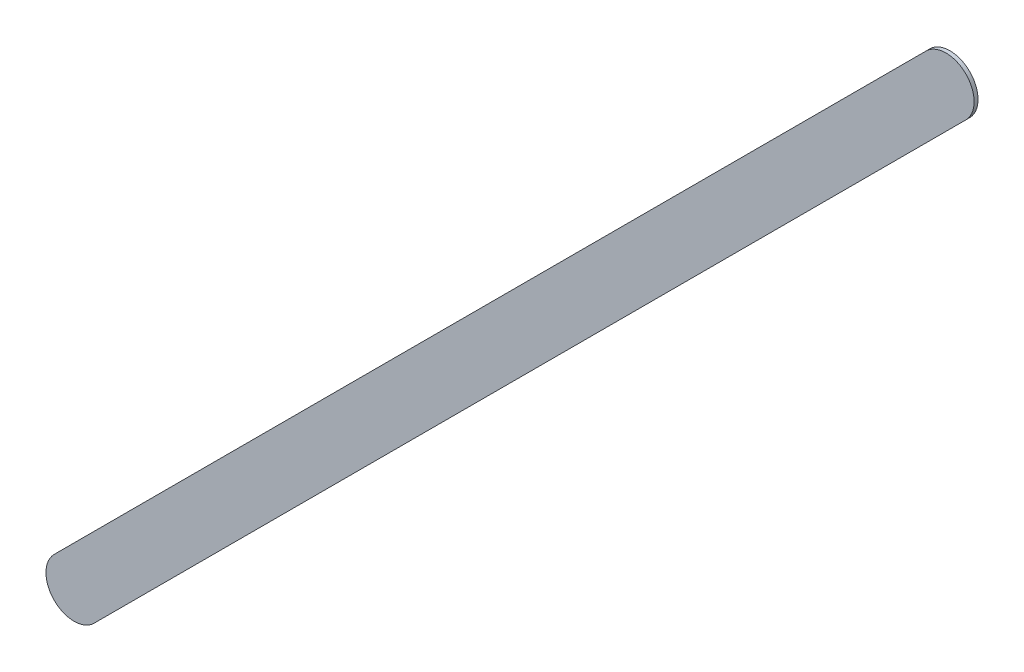
ISO-10303-21;
HEADER;
FILE_DESCRIPTION(('STEP AP214'),'2;1');
FILE_NAME('part.step','',(''),(''),'','','');
FILE_SCHEMA(('AUTOMOTIVE_DESIGN { 1 0 10303 214 1 1 1 1 }'));
ENDSEC;
DATA;
#1=APPLICATION_CONTEXT('core data for automotive mechanical design processes');
#2=APPLICATION_PROTOCOL_DEFINITION('international standard','automotive_design',2000,#1);
#3=PRODUCT_CONTEXT('',#1,'mechanical');
#4=PRODUCT('Part','Part','',(#3));
#5=PRODUCT_RELATED_PRODUCT_CATEGORY('part','',(#4));
#6=PRODUCT_DEFINITION_FORMATION('','',#4);
#7=PRODUCT_DEFINITION_CONTEXT('part definition',#1,'design');
#8=PRODUCT_DEFINITION('design','',#6,#7);
#9=PRODUCT_DEFINITION_SHAPE('','',#8);
#10=(LENGTH_UNIT() NAMED_UNIT(*) SI_UNIT(.MILLI.,.METRE.));
#11=(NAMED_UNIT(*) PLANE_ANGLE_UNIT() SI_UNIT($,.RADIAN.));
#12=(NAMED_UNIT(*) SI_UNIT($,.STERADIAN.) SOLID_ANGLE_UNIT());
#13=UNCERTAINTY_MEASURE_WITH_UNIT(LENGTH_MEASURE(1.E-05),#10,'distance_accuracy_value','');
#14=(GEOMETRIC_REPRESENTATION_CONTEXT(3) GLOBAL_UNCERTAINTY_ASSIGNED_CONTEXT((#13)) GLOBAL_UNIT_ASSIGNED_CONTEXT((#10,
#11,#12)) REPRESENTATION_CONTEXT('',''));
#15=CARTESIAN_POINT('',(0.,0.,0.));
#16=DIRECTION('',(0.,0.,1.));
#17=DIRECTION('',(1.,0.,0.));
#18=AXIS2_PLACEMENT_3D('',#15,#16,#17);
#19=CARTESIAN_POINT('',(126.950223,-70.435223,0.));
#20=DIRECTION('',(0.,0.,1.));
#21=DIRECTION('',(1.,0.,0.));
#22=AXIS2_PLACEMENT_3D('',#19,#20,#21);
#23=PLANE('',#22);
#24=DIRECTION('',(-0.707106781186548,-0.707106781186548,0.));
#25=VECTOR('',#24,1.);
#26=CARTESIAN_POINT('',(126.950223,-70.435223,0.));
#27=LINE('',#26,#25);
#28=CARTESIAN_POINT('',(126.950223,-70.435223,0.));
#29=VERTEX_POINT('',#28);
#30=CARTESIAN_POINT('',(119.203223,-78.182223,0.));
#31=VERTEX_POINT('',#30);
#32=EDGE_CURVE('E92',#29,#31,#27,.T.);
#33=ORIENTED_EDGE('',*,*,#32,.T.);
#34=CARTESIAN_POINT('',(119.3799995,-78.3589995,0.));
#35=DIRECTION('',(0.,0.,1.));
#36=DIRECTION('',(-0.707106781186548,0.707106781186548,0.));
#37=AXIS2_PLACEMENT_3D('',#34,#35,#36);
#38=CIRCLE('',#37,0.249999723809);
#39=CARTESIAN_POINT('',(119.556776,-78.535776,0.));
#40=VERTEX_POINT('',#39);
#41=EDGE_CURVE('E72',#31,#40,#38,.T.);
#42=ORIENTED_EDGE('',*,*,#41,.T.);
#43=DIRECTION('',(0.707106781186548,0.707106781186548,0.));
#44=VECTOR('',#43,1.);
#45=CARTESIAN_POINT('',(119.556776,-78.535776,0.));
#46=LINE('',#45,#44);
#47=CARTESIAN_POINT('',(127.303776,-70.788776,0.));
#48=VERTEX_POINT('',#47);
#49=EDGE_CURVE('E86',#40,#48,#46,.T.);
#50=ORIENTED_EDGE('',*,*,#49,.T.);
#51=CARTESIAN_POINT('',(127.1269995,-70.6119995,0.));
#52=DIRECTION('',(0.,0.,1.));
#53=DIRECTION('',(0.707106781186548,-0.707106781186548,0.));
#54=AXIS2_PLACEMENT_3D('',#51,#52,#53);
#55=CIRCLE('',#54,0.249999723809);
#56=EDGE_CURVE('E11',#48,#29,#55,.T.);
#57=ORIENTED_EDGE('',*,*,#56,.T.);
#58=EDGE_LOOP('',(#33,#42,#50,#57));
#59=FACE_BOUND('',#58,.T.);
#60=ADVANCED_FACE('F17',(#59),#23,.T.);
#61=CARTESIAN_POINT('',(126.950223,-70.435223,-0.035));
#62=DIRECTION('',(0.,0.,1.));
#63=DIRECTION('',(1.,0.,0.));
#64=AXIS2_PLACEMENT_3D('',#61,#62,#63);
#65=PLANE('',#64);
#66=CARTESIAN_POINT('',(127.1269995,-70.6119995,-0.035));
#67=DIRECTION('',(0.,0.,1.));
#68=DIRECTION('',(0.707106781186548,-0.707106781186548,0.));
#69=AXIS2_PLACEMENT_3D('',#66,#67,#68);
#70=CIRCLE('',#69,0.249999723809);
#71=CARTESIAN_POINT('',(127.303776,-70.788776,-0.035));
#72=VERTEX_POINT('',#71);
#73=CARTESIAN_POINT('',(126.950223,-70.435223,-0.035));
#74=VERTEX_POINT('',#73);
#75=EDGE_CURVE('E25',#72,#74,#70,.T.);
#76=ORIENTED_EDGE('',*,*,#75,.F.);
#77=DIRECTION('',(0.707106781186548,0.707106781186548,0.));
#78=VECTOR('',#77,1.);
#79=CARTESIAN_POINT('',(119.556776,-78.535776,-0.035));
#80=LINE('',#79,#78);
#81=CARTESIAN_POINT('',(119.556776,-78.535776,-0.035));
#82=VERTEX_POINT('',#81);
#83=EDGE_CURVE('E57',#82,#72,#80,.T.);
#84=ORIENTED_EDGE('',*,*,#83,.F.);
#85=CARTESIAN_POINT('',(119.3799995,-78.3589995,-0.035));
#86=DIRECTION('',(0.,0.,1.));
#87=DIRECTION('',(-0.707106781186548,0.707106781186548,0.));
#88=AXIS2_PLACEMENT_3D('',#85,#86,#87);
#89=CIRCLE('',#88,0.249999723809);
#90=CARTESIAN_POINT('',(119.203223,-78.182223,-0.035));
#91=VERTEX_POINT('',#90);
#92=EDGE_CURVE('E94',#91,#82,#89,.T.);
#93=ORIENTED_EDGE('',*,*,#92,.F.);
#94=DIRECTION('',(-0.707106781186548,-0.707106781186548,0.));
#95=VECTOR('',#94,1.);
#96=CARTESIAN_POINT('',(126.950223,-70.435223,-0.035));
#97=LINE('',#96,#95);
#98=EDGE_CURVE('E91',#74,#91,#97,.T.);
#99=ORIENTED_EDGE('',*,*,#98,.F.);
#100=EDGE_LOOP('',(#76,#84,#93,#99));
#101=FACE_BOUND('',#100,.T.);
#102=ADVANCED_FACE('F96',(#101),#65,.F.);
#103=CARTESIAN_POINT('',(127.1269995,-70.6119995,-0.035));
#104=DIRECTION('',(0.,0.,-1.));
#105=DIRECTION('',(0.707106781186548,-0.707106781186548,0.));
#106=AXIS2_PLACEMENT_3D('',#103,#104,#105);
#107=CYLINDRICAL_SURFACE('',#106,0.249999723809);
#108=ORIENTED_EDGE('',*,*,#75,.T.);
#109=DIRECTION('',(0.,0.,1.));
#110=VECTOR('',#109,1.);
#111=CARTESIAN_POINT('',(126.950223,-70.435223,-0.035));
#112=LINE('',#111,#110);
#113=EDGE_CURVE('E81',#74,#29,#112,.T.);
#114=ORIENTED_EDGE('',*,*,#113,.T.);
#115=ORIENTED_EDGE('',*,*,#56,.F.);
#116=DIRECTION('',(0.,0.,1.));
#117=VECTOR('',#116,1.);
#118=CARTESIAN_POINT('',(127.303776,-70.788776,-0.035));
#119=LINE('',#118,#117);
#120=EDGE_CURVE('E84',#72,#48,#119,.T.);
#121=ORIENTED_EDGE('',*,*,#120,.F.);
#122=EDGE_LOOP('',(#108,#114,#115,#121));
#123=FACE_BOUND('',#122,.T.);
#124=ADVANCED_FACE('F80',(#123),#107,.T.);
#125=CARTESIAN_POINT('',(119.556776,-78.535776,-0.035));
#126=DIRECTION('',(-0.707106781186548,0.707106781186548,0.));
#127=DIRECTION('',(0.,0.,1.));
#128=AXIS2_PLACEMENT_3D('',#125,#126,#127);
#129=PLANE('',#128);
#130=ORIENTED_EDGE('',*,*,#83,.T.);
#131=ORIENTED_EDGE('',*,*,#120,.T.);
#132=ORIENTED_EDGE('',*,*,#49,.F.);
#133=DIRECTION('',(0.,0.,1.));
#134=VECTOR('',#133,1.);
#135=CARTESIAN_POINT('',(119.556776,-78.535776,-0.035));
#136=LINE('',#135,#134);
#137=EDGE_CURVE('E112',#82,#40,#136,.T.);
#138=ORIENTED_EDGE('',*,*,#137,.F.);
#139=EDGE_LOOP('',(#130,#131,#132,#138));
#140=FACE_BOUND('',#139,.T.);
#141=ADVANCED_FACE('F123',(#140),#129,.F.);
#142=CARTESIAN_POINT('',(119.3799995,-78.3589995,-0.035));
#143=DIRECTION('',(0.,0.,-1.));
#144=DIRECTION('',(-0.707106781186548,0.707106781186548,0.));
#145=AXIS2_PLACEMENT_3D('',#142,#143,#144);
#146=CYLINDRICAL_SURFACE('',#145,0.249999723809);
#147=ORIENTED_EDGE('',*,*,#92,.T.);
#148=ORIENTED_EDGE('',*,*,#137,.T.);
#149=ORIENTED_EDGE('',*,*,#41,.F.);
#150=DIRECTION('',(0.,0.,1.));
#151=VECTOR('',#150,1.);
#152=CARTESIAN_POINT('',(119.203223,-78.182223,-0.035));
#153=LINE('',#152,#151);
#154=EDGE_CURVE('E99',#91,#31,#153,.T.);
#155=ORIENTED_EDGE('',*,*,#154,.F.);
#156=EDGE_LOOP('',(#147,#148,#149,#155));
#157=FACE_BOUND('',#156,.T.);
#158=ADVANCED_FACE('F124',(#157),#146,.T.);
#159=CARTESIAN_POINT('',(126.950223,-70.435223,-0.035));
#160=DIRECTION('',(0.707106781186548,-0.707106781186548,0.));
#161=DIRECTION('',(0.,0.,-1.));
#162=AXIS2_PLACEMENT_3D('',#159,#160,#161);
#163=PLANE('',#162);
#164=ORIENTED_EDGE('',*,*,#98,.T.);
#165=ORIENTED_EDGE('',*,*,#154,.T.);
#166=ORIENTED_EDGE('',*,*,#32,.F.);
#167=ORIENTED_EDGE('',*,*,#113,.F.);
#168=EDGE_LOOP('',(#164,#165,#166,#167));
#169=FACE_BOUND('',#168,.T.);
#170=ADVANCED_FACE('F89',(#169),#163,.F.);
#171=CLOSED_SHELL('',(#60,#102,#124,#141,#158,#170));
#172=MANIFOLD_SOLID_BREP('B1',#171);
#173=ADVANCED_BREP_SHAPE_REPRESENTATION('',(#18,#172),#14);
#174=SHAPE_DEFINITION_REPRESENTATION(#9,#173);
ENDSEC;
END-ISO-10303-21;
